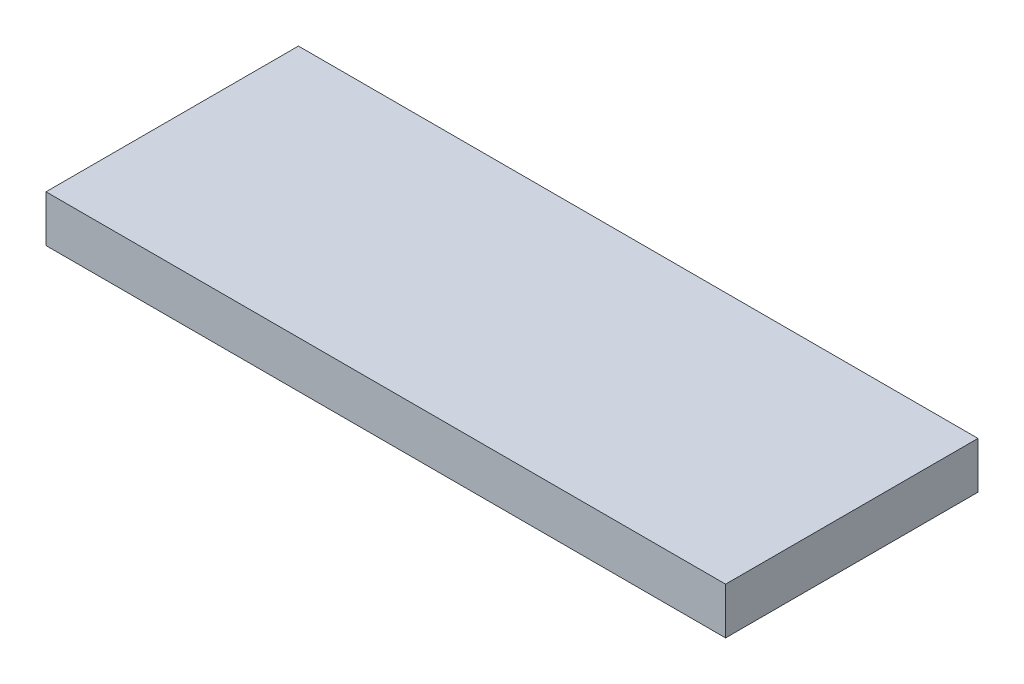
ISO-10303-21;
HEADER;
FILE_DESCRIPTION(('STEP AP214'),'2;1');
FILE_NAME('part.step','',(''),(''),'','','');
FILE_SCHEMA(('AUTOMOTIVE_DESIGN { 1 0 10303 214 1 1 1 1 }'));
ENDSEC;
DATA;
#1=APPLICATION_CONTEXT('core data for automotive mechanical design processes');
#2=APPLICATION_PROTOCOL_DEFINITION('international standard','automotive_design',2000,#1);
#3=PRODUCT_CONTEXT('',#1,'mechanical');
#4=PRODUCT('Part','Part','',(#3));
#5=PRODUCT_RELATED_PRODUCT_CATEGORY('part','',(#4));
#6=PRODUCT_DEFINITION_FORMATION('','',#4);
#7=PRODUCT_DEFINITION_CONTEXT('part definition',#1,'design');
#8=PRODUCT_DEFINITION('design','',#6,#7);
#9=PRODUCT_DEFINITION_SHAPE('','',#8);
#10=(LENGTH_UNIT() NAMED_UNIT(*) SI_UNIT(.MILLI.,.METRE.));
#11=(NAMED_UNIT(*) PLANE_ANGLE_UNIT() SI_UNIT($,.RADIAN.));
#12=(NAMED_UNIT(*) SI_UNIT($,.STERADIAN.) SOLID_ANGLE_UNIT());
#13=UNCERTAINTY_MEASURE_WITH_UNIT(LENGTH_MEASURE(1.E-05),#10,'distance_accuracy_value','');
#14=(GEOMETRIC_REPRESENTATION_CONTEXT(3) GLOBAL_UNCERTAINTY_ASSIGNED_CONTEXT((#13)) GLOBAL_UNIT_ASSIGNED_CONTEXT((#10,
#11,#12)) REPRESENTATION_CONTEXT('',''));
#15=CARTESIAN_POINT('',(0.,0.,0.));
#16=DIRECTION('',(0.,0.,1.));
#17=DIRECTION('',(1.,0.,0.));
#18=AXIS2_PLACEMENT_3D('',#15,#16,#17);
#19=CARTESIAN_POINT('',(-64.3688910670043,12.,26.2316561844864));
#20=DIRECTION('',(1.,0.,0.));
#21=DIRECTION('',(0.,0.,-1.));
#22=AXIS2_PLACEMENT_3D('',#19,#20,#21);
#23=PLANE('',#22);
#24=DIRECTION('',(0.,0.,1.));
#25=VECTOR('',#24,1.);
#26=CARTESIAN_POINT('',(-64.3688910670043,0.,26.2316561844864));
#27=LINE('',#26,#25);
#28=CARTESIAN_POINT('',(-64.3688910670043,0.,-38.7683438155136));
#29=VERTEX_POINT('',#28);
#30=CARTESIAN_POINT('',(-64.3688910670043,0.,26.2316561844864));
#31=VERTEX_POINT('',#30);
#32=EDGE_CURVE('E113',#29,#31,#27,.T.);
#33=ORIENTED_EDGE('',*,*,#32,.T.);
#34=DIRECTION('',(0.,-1.,0.));
#35=VECTOR('',#34,1.);
#36=CARTESIAN_POINT('',(-64.3688910670043,12.,26.2316561844864));
#37=LINE('',#36,#35);
#38=CARTESIAN_POINT('',(-64.3688910670043,12.,26.2316561844864));
#39=VERTEX_POINT('',#38);
#40=EDGE_CURVE('E11',#39,#31,#37,.T.);
#41=ORIENTED_EDGE('',*,*,#40,.F.);
#42=DIRECTION('',(0.,0.,1.));
#43=VECTOR('',#42,1.);
#44=CARTESIAN_POINT('',(-64.3688910670043,12.,26.2316561844864));
#45=LINE('',#44,#43);
#46=CARTESIAN_POINT('',(-64.3688910670043,12.,-38.7683438155136));
#47=VERTEX_POINT('',#46);
#48=EDGE_CURVE('E97',#47,#39,#45,.T.);
#49=ORIENTED_EDGE('',*,*,#48,.F.);
#50=DIRECTION('',(0.,-1.,0.));
#51=VECTOR('',#50,1.);
#52=CARTESIAN_POINT('',(-64.3688910670043,12.,-38.7683438155136));
#53=LINE('',#52,#51);
#54=EDGE_CURVE('E109',#47,#29,#53,.T.);
#55=ORIENTED_EDGE('',*,*,#54,.T.);
#56=EDGE_LOOP('',(#33,#41,#49,#55));
#57=FACE_BOUND('',#56,.T.);
#58=ADVANCED_FACE('F45',(#57),#23,.F.);
#59=CARTESIAN_POINT('',(-64.3688910670043,12.,26.2316561844864));
#60=DIRECTION('',(0.,0.,-1.));
#61=DIRECTION('',(-1.,0.,0.));
#62=AXIS2_PLACEMENT_3D('',#59,#60,#61);
#63=PLANE('',#62);
#64=DIRECTION('',(1.,0.,0.));
#65=VECTOR('',#64,1.);
#66=CARTESIAN_POINT('',(-64.3688910670043,0.,26.2316561844864));
#67=LINE('',#66,#65);
#68=CARTESIAN_POINT('',(110.631108932996,0.,26.2316561844864));
#69=VERTEX_POINT('',#68);
#70=EDGE_CURVE('E102',#31,#69,#67,.T.);
#71=ORIENTED_EDGE('',*,*,#70,.T.);
#72=DIRECTION('',(0.,-1.,0.));
#73=VECTOR('',#72,1.);
#74=CARTESIAN_POINT('',(110.631108932996,12.,26.2316561844864));
#75=LINE('',#74,#73);
#76=CARTESIAN_POINT('',(110.631108932996,12.,26.2316561844864));
#77=VERTEX_POINT('',#76);
#78=EDGE_CURVE('E54',#77,#69,#75,.T.);
#79=ORIENTED_EDGE('',*,*,#78,.F.);
#80=DIRECTION('',(1.,0.,0.));
#81=VECTOR('',#80,1.);
#82=CARTESIAN_POINT('',(-64.3688910670043,12.,26.2316561844864));
#83=LINE('',#82,#81);
#84=EDGE_CURVE('E92',#39,#77,#83,.T.);
#85=ORIENTED_EDGE('',*,*,#84,.F.);
#86=ORIENTED_EDGE('',*,*,#40,.T.);
#87=EDGE_LOOP('',(#71,#79,#85,#86));
#88=FACE_BOUND('',#87,.T.);
#89=ADVANCED_FACE('F101',(#88),#63,.F.);
#90=CARTESIAN_POINT('',(110.631108932996,12.,26.2316561844864));
#91=DIRECTION('',(-1.,0.,0.));
#92=DIRECTION('',(0.,0.,1.));
#93=AXIS2_PLACEMENT_3D('',#90,#91,#92);
#94=PLANE('',#93);
#95=DIRECTION('',(0.,0.,-1.));
#96=VECTOR('',#95,1.);
#97=CARTESIAN_POINT('',(110.631108932996,0.,26.2316561844864));
#98=LINE('',#97,#96);
#99=CARTESIAN_POINT('',(110.631108932996,0.,-38.7683438155136));
#100=VERTEX_POINT('',#99);
#101=EDGE_CURVE('E79',#69,#100,#98,.T.);
#102=ORIENTED_EDGE('',*,*,#101,.T.);
#103=DIRECTION('',(0.,-1.,0.));
#104=VECTOR('',#103,1.);
#105=CARTESIAN_POINT('',(110.631108932996,12.,-38.7683438155136));
#106=LINE('',#105,#104);
#107=CARTESIAN_POINT('',(110.631108932996,12.,-38.7683438155136));
#108=VERTEX_POINT('',#107);
#109=EDGE_CURVE('E104',#108,#100,#106,.T.);
#110=ORIENTED_EDGE('',*,*,#109,.F.);
#111=DIRECTION('',(0.,0.,-1.));
#112=VECTOR('',#111,1.);
#113=CARTESIAN_POINT('',(110.631108932996,12.,26.2316561844864));
#114=LINE('',#113,#112);
#115=EDGE_CURVE('E95',#77,#108,#114,.T.);
#116=ORIENTED_EDGE('',*,*,#115,.F.);
#117=ORIENTED_EDGE('',*,*,#78,.T.);
#118=EDGE_LOOP('',(#102,#110,#116,#117));
#119=FACE_BOUND('',#118,.T.);
#120=ADVANCED_FACE('F105',(#119),#94,.F.);
#121=CARTESIAN_POINT('',(-64.3688910670043,12.,-38.7683438155136));
#122=DIRECTION('',(0.,0.,1.));
#123=DIRECTION('',(1.,0.,0.));
#124=AXIS2_PLACEMENT_3D('',#121,#122,#123);
#125=PLANE('',#124);
#126=DIRECTION('',(-1.,0.,0.));
#127=VECTOR('',#126,1.);
#128=CARTESIAN_POINT('',(-64.3688910670043,0.,-38.7683438155136));
#129=LINE('',#128,#127);
#130=EDGE_CURVE('E85',#100,#29,#129,.T.);
#131=ORIENTED_EDGE('',*,*,#130,.T.);
#132=ORIENTED_EDGE('',*,*,#54,.F.);
#133=DIRECTION('',(-1.,0.,0.));
#134=VECTOR('',#133,1.);
#135=CARTESIAN_POINT('',(-64.3688910670043,12.,-38.7683438155136));
#136=LINE('',#135,#134);
#137=EDGE_CURVE('E62',#108,#47,#136,.T.);
#138=ORIENTED_EDGE('',*,*,#137,.F.);
#139=ORIENTED_EDGE('',*,*,#109,.T.);
#140=EDGE_LOOP('',(#131,#132,#138,#139));
#141=FACE_BOUND('',#140,.T.);
#142=ADVANCED_FACE('F126',(#141),#125,.F.);
#143=CARTESIAN_POINT('',(0.,12.,0.));
#144=DIRECTION('',(0.,-1.,0.));
#145=DIRECTION('',(0.,0.,-1.));
#146=AXIS2_PLACEMENT_3D('',#143,#144,#145);
#147=PLANE('',#146);
#148=ORIENTED_EDGE('',*,*,#48,.T.);
#149=ORIENTED_EDGE('',*,*,#84,.T.);
#150=ORIENTED_EDGE('',*,*,#115,.T.);
#151=ORIENTED_EDGE('',*,*,#137,.T.);
#152=EDGE_LOOP('',(#148,#149,#150,#151));
#153=FACE_BOUND('',#152,.T.);
#154=ADVANCED_FACE('F93',(#153),#147,.F.);
#155=CARTESIAN_POINT('',(0.,0.,0.));
#156=DIRECTION('',(0.,-1.,0.));
#157=DIRECTION('',(0.,0.,-1.));
#158=AXIS2_PLACEMENT_3D('',#155,#156,#157);
#159=PLANE('',#158);
#160=ORIENTED_EDGE('',*,*,#32,.F.);
#161=ORIENTED_EDGE('',*,*,#130,.F.);
#162=ORIENTED_EDGE('',*,*,#101,.F.);
#163=ORIENTED_EDGE('',*,*,#70,.F.);
#164=EDGE_LOOP('',(#160,#161,#162,#163));
#165=FACE_BOUND('',#164,.T.);
#166=ADVANCED_FACE('F129',(#165),#159,.T.);
#167=CLOSED_SHELL('',(#58,#89,#120,#142,#154,#166));
#168=MANIFOLD_SOLID_BREP('B2',#167);
#169=ADVANCED_BREP_SHAPE_REPRESENTATION('',(#18,#168),#14);
#170=SHAPE_DEFINITION_REPRESENTATION(#9,#169);
ENDSEC;
END-ISO-10303-21;
